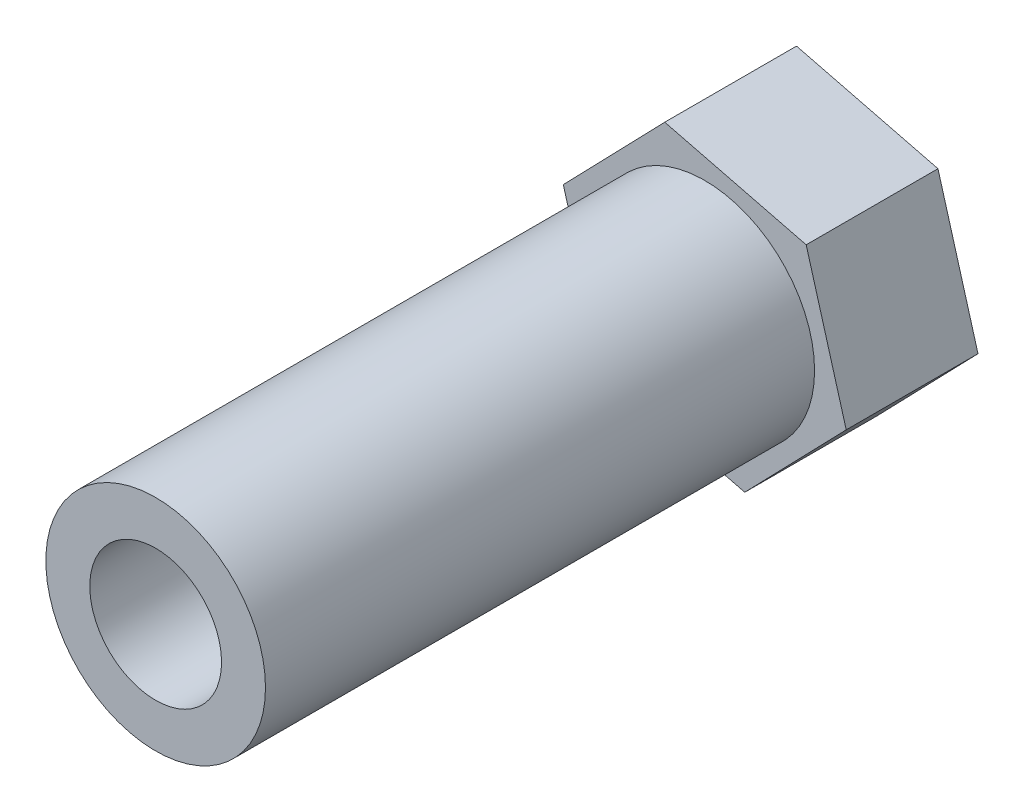
ISO-10303-21;
HEADER;
FILE_DESCRIPTION(('STEP AP214'),'2;1');
FILE_NAME('part.step','',(''),(''),'','','');
FILE_SCHEMA(('AUTOMOTIVE_DESIGN { 1 0 10303 214 1 1 1 1 }'));
ENDSEC;
DATA;
#1=APPLICATION_CONTEXT('core data for automotive mechanical design processes');
#2=APPLICATION_PROTOCOL_DEFINITION('international standard','automotive_design',2000,#1);
#3=PRODUCT_CONTEXT('',#1,'mechanical');
#4=PRODUCT('Part','Part','',(#3));
#5=PRODUCT_RELATED_PRODUCT_CATEGORY('part','',(#4));
#6=PRODUCT_DEFINITION_FORMATION('','',#4);
#7=PRODUCT_DEFINITION_CONTEXT('part definition',#1,'design');
#8=PRODUCT_DEFINITION('design','',#6,#7);
#9=PRODUCT_DEFINITION_SHAPE('','',#8);
#10=(LENGTH_UNIT() NAMED_UNIT(*) SI_UNIT(.MILLI.,.METRE.));
#11=(NAMED_UNIT(*) PLANE_ANGLE_UNIT() SI_UNIT($,.RADIAN.));
#12=(NAMED_UNIT(*) SI_UNIT($,.STERADIAN.) SOLID_ANGLE_UNIT());
#13=UNCERTAINTY_MEASURE_WITH_UNIT(LENGTH_MEASURE(1.E-05),#10,'distance_accuracy_value','');
#14=(GEOMETRIC_REPRESENTATION_CONTEXT(3) GLOBAL_UNCERTAINTY_ASSIGNED_CONTEXT((#13)) GLOBAL_UNIT_ASSIGNED_CONTEXT((#10,
#11,#12)) REPRESENTATION_CONTEXT('',''));
#15=CARTESIAN_POINT('',(0.,0.,0.));
#16=DIRECTION('',(0.,0.,1.));
#17=DIRECTION('',(1.,0.,0.));
#18=AXIS2_PLACEMENT_3D('',#15,#16,#17);
#19=CARTESIAN_POINT('',(0.,0.,6.));
#20=DIRECTION('',(0.,0.,1.));
#21=DIRECTION('',(1.,0.,0.));
#22=AXIS2_PLACEMENT_3D('',#19,#20,#21);
#23=PLANE('',#22);
#24=CARTESIAN_POINT('',(0.,0.,6.));
#25=DIRECTION('',(0.,0.,1.));
#26=DIRECTION('',(1.,0.,0.));
#27=AXIS2_PLACEMENT_3D('',#24,#25,#26);
#28=CIRCLE('',#27,1.5);
#29=CARTESIAN_POINT('',(1.5,0.,6.));
#30=VERTEX_POINT('',#29);
#31=EDGE_CURVE('E123',#30,#30,#28,.T.);
#32=ORIENTED_EDGE('',*,*,#31,.F.);
#33=EDGE_LOOP('',(#32));
#34=FACE_BOUND('',#33,.T.);
#35=CARTESIAN_POINT('',(0.,0.,6.));
#36=DIRECTION('',(0.,0.,1.));
#37=DIRECTION('',(1.,0.,0.));
#38=AXIS2_PLACEMENT_3D('',#35,#36,#37);
#39=CIRCLE('',#38,3.);
#40=CARTESIAN_POINT('',(3.,0.,6.));
#41=VERTEX_POINT('',#40);
#42=EDGE_CURVE('E158',#41,#41,#39,.T.);
#43=ORIENTED_EDGE('',*,*,#42,.T.);
#44=EDGE_LOOP('',(#43));
#45=FACE_BOUND('',#44,.T.);
#46=ADVANCED_FACE('F32',(#34,#45),#23,.T.);
#47=CARTESIAN_POINT('',(0.,0.,6.));
#48=DIRECTION('',(0.,0.,1.));
#49=DIRECTION('',(1.,0.,0.));
#50=AXIS2_PLACEMENT_3D('',#47,#48,#49);
#51=CIRCLE('',#50,5.);
#52=CARTESIAN_POINT('',(5.,0.,6.));
#53=VERTEX_POINT('',#52);
#54=EDGE_CURVE('E11',#53,#53,#51,.T.);
#55=ORIENTED_EDGE('',*,*,#54,.F.);
#56=EDGE_LOOP('',(#55));
#57=FACE_BOUND('',#56,.T.);
#58=DIRECTION('',(-0.69547698441572,-0.71854837286575,0.));
#59=VECTOR('',#58,1.);
#60=CARTESIAN_POINT('',(-1.82283365501434,6.38440371526429,6.));
#61=LINE('',#60,#59);
#62=CARTESIAN_POINT('',(-1.82283365501434,6.38440371526429,6.));
#63=VERTEX_POINT('',#62);
#64=CARTESIAN_POINT('',(-6.44047263294179,1.61358160551649,6.));
#65=VERTEX_POINT('',#64);
#66=EDGE_CURVE('E130',#63,#65,#61,.T.);
#67=ORIENTED_EDGE('',*,*,#66,.T.);
#68=DIRECTION('',(0.274542652541853,-0.961574922684282,0.));
#69=VECTOR('',#68,1.);
#70=CARTESIAN_POINT('',(-6.44047263294179,1.61358160551649,6.));
#71=LINE('',#70,#69);
#72=CARTESIAN_POINT('',(-4.61763897792746,-4.7708221097478,6.));
#73=VERTEX_POINT('',#72);
#74=EDGE_CURVE('E88',#65,#73,#71,.T.);
#75=ORIENTED_EDGE('',*,*,#74,.T.);
#76=DIRECTION('',(0.970019636957572,-0.243026549818532,0.));
#77=VECTOR('',#76,1.);
#78=CARTESIAN_POINT('',(-4.61763897792746,-4.7708221097478,6.));
#79=LINE('',#78,#77);
#80=CARTESIAN_POINT('',(1.82283365501434,-6.38440371526429,6.));
#81=VERTEX_POINT('',#80);
#82=EDGE_CURVE('E101',#73,#81,#79,.T.);
#83=ORIENTED_EDGE('',*,*,#82,.T.);
#84=DIRECTION('',(0.69547698441572,0.71854837286575,0.));
#85=VECTOR('',#84,1.);
#86=CARTESIAN_POINT('',(1.82283365501434,-6.38440371526429,6.));
#87=LINE('',#86,#85);
#88=CARTESIAN_POINT('',(6.44047263294179,-1.61358160551649,6.));
#89=VERTEX_POINT('',#88);
#90=EDGE_CURVE('E95',#81,#89,#87,.T.);
#91=ORIENTED_EDGE('',*,*,#90,.T.);
#92=DIRECTION('',(-0.274542652541853,0.961574922684282,0.));
#93=VECTOR('',#92,1.);
#94=CARTESIAN_POINT('',(6.44047263294179,-1.61358160551649,6.));
#95=LINE('',#94,#93);
#96=CARTESIAN_POINT('',(4.61763897792746,4.7708221097478,6.));
#97=VERTEX_POINT('',#96);
#98=EDGE_CURVE('E99',#89,#97,#95,.T.);
#99=ORIENTED_EDGE('',*,*,#98,.T.);
#100=DIRECTION('',(-0.970019636957572,0.243026549818532,0.));
#101=VECTOR('',#100,1.);
#102=CARTESIAN_POINT('',(4.61763897792746,4.7708221097478,6.));
#103=LINE('',#102,#101);
#104=EDGE_CURVE('E50',#97,#63,#103,.T.);
#105=ORIENTED_EDGE('',*,*,#104,.T.);
#106=EDGE_LOOP('',(#67,#75,#83,#91,#99,#105));
#107=FACE_BOUND('',#106,.T.);
#108=ADVANCED_FACE('F97',(#57,#107),#23,.T.);
#109=CARTESIAN_POINT('',(0.,0.,0.));
#110=DIRECTION('',(0.,0.,1.));
#111=DIRECTION('',(1.,0.,0.));
#112=AXIS2_PLACEMENT_3D('',#109,#110,#111);
#113=PLANE('',#112);
#114=DIRECTION('',(-0.69547698441572,-0.71854837286575,0.));
#115=VECTOR('',#114,1.);
#116=CARTESIAN_POINT('',(-1.82283365501434,6.38440371526429,0.));
#117=LINE('',#116,#115);
#118=CARTESIAN_POINT('',(-1.82283365501434,6.38440371526429,0.));
#119=VERTEX_POINT('',#118);
#120=CARTESIAN_POINT('',(-6.44047263294179,1.61358160551649,0.));
#121=VERTEX_POINT('',#120);
#122=EDGE_CURVE('E119',#119,#121,#117,.T.);
#123=ORIENTED_EDGE('',*,*,#122,.F.);
#124=DIRECTION('',(-0.970019636957572,0.243026549818532,0.));
#125=VECTOR('',#124,1.);
#126=CARTESIAN_POINT('',(4.61763897792746,4.7708221097478,0.));
#127=LINE('',#126,#125);
#128=CARTESIAN_POINT('',(4.61763897792746,4.7708221097478,0.));
#129=VERTEX_POINT('',#128);
#130=EDGE_CURVE('E79',#129,#119,#127,.T.);
#131=ORIENTED_EDGE('',*,*,#130,.F.);
#132=DIRECTION('',(-0.274542652541853,0.961574922684282,0.));
#133=VECTOR('',#132,1.);
#134=CARTESIAN_POINT('',(6.44047263294179,-1.61358160551649,0.));
#135=LINE('',#134,#133);
#136=CARTESIAN_POINT('',(6.44047263294179,-1.61358160551649,0.));
#137=VERTEX_POINT('',#136);
#138=EDGE_CURVE('E73',#137,#129,#135,.T.);
#139=ORIENTED_EDGE('',*,*,#138,.F.);
#140=DIRECTION('',(0.69547698441572,0.71854837286575,0.));
#141=VECTOR('',#140,1.);
#142=CARTESIAN_POINT('',(1.82283365501434,-6.38440371526429,0.));
#143=LINE('',#142,#141);
#144=CARTESIAN_POINT('',(1.82283365501434,-6.38440371526429,0.));
#145=VERTEX_POINT('',#144);
#146=EDGE_CURVE('E109',#145,#137,#143,.T.);
#147=ORIENTED_EDGE('',*,*,#146,.F.);
#148=DIRECTION('',(0.970019636957572,-0.243026549818532,0.));
#149=VECTOR('',#148,1.);
#150=CARTESIAN_POINT('',(-4.61763897792746,-4.7708221097478,0.));
#151=LINE('',#150,#149);
#152=CARTESIAN_POINT('',(-4.61763897792746,-4.7708221097478,0.));
#153=VERTEX_POINT('',#152);
#154=EDGE_CURVE('E125',#153,#145,#151,.T.);
#155=ORIENTED_EDGE('',*,*,#154,.F.);
#156=DIRECTION('',(0.274542652541853,-0.961574922684282,0.));
#157=VECTOR('',#156,1.);
#158=CARTESIAN_POINT('',(-6.44047263294179,1.61358160551649,0.));
#159=LINE('',#158,#157);
#160=EDGE_CURVE('E122',#121,#153,#159,.T.);
#161=ORIENTED_EDGE('',*,*,#160,.F.);
#162=EDGE_LOOP('',(#123,#131,#139,#147,#155,#161));
#163=FACE_BOUND('',#162,.T.);
#164=CARTESIAN_POINT('',(0.,0.,0.));
#165=DIRECTION('',(0.,0.,1.));
#166=DIRECTION('',(1.,0.,0.));
#167=AXIS2_PLACEMENT_3D('',#164,#165,#166);
#168=CIRCLE('',#167,1.5);
#169=CARTESIAN_POINT('',(1.5,0.,0.));
#170=VERTEX_POINT('',#169);
#171=EDGE_CURVE('E149',#170,#170,#168,.T.);
#172=ORIENTED_EDGE('',*,*,#171,.T.);
#173=EDGE_LOOP('',(#172));
#174=FACE_BOUND('',#173,.T.);
#175=ADVANCED_FACE('F143',(#163,#174),#113,.F.);
#176=CARTESIAN_POINT('',(-1.82283365501434,6.38440371526429,6.));
#177=DIRECTION('',(0.71854837286575,-0.695476984415719,0.));
#178=DIRECTION('',(0.69547698441572,0.71854837286575,0.));
#179=AXIS2_PLACEMENT_3D('',#176,#177,#178);
#180=PLANE('',#179);
#181=ORIENTED_EDGE('',*,*,#122,.T.);
#182=DIRECTION('',(0.,0.,-1.));
#183=VECTOR('',#182,1.);
#184=CARTESIAN_POINT('',(-6.44047263294179,1.61358160551649,6.));
#185=LINE('',#184,#183);
#186=EDGE_CURVE('E36',#65,#121,#185,.T.);
#187=ORIENTED_EDGE('',*,*,#186,.F.);
#188=ORIENTED_EDGE('',*,*,#66,.F.);
#189=DIRECTION('',(0.,0.,-1.));
#190=VECTOR('',#189,1.);
#191=CARTESIAN_POINT('',(-1.82283365501434,6.38440371526429,6.));
#192=LINE('',#191,#190);
#193=EDGE_CURVE('E115',#63,#119,#192,.T.);
#194=ORIENTED_EDGE('',*,*,#193,.T.);
#195=EDGE_LOOP('',(#181,#187,#188,#194));
#196=FACE_BOUND('',#195,.T.);
#197=ADVANCED_FACE('F34',(#196),#180,.F.);
#198=CARTESIAN_POINT('',(-6.44047263294179,1.61358160551649,6.));
#199=DIRECTION('',(0.961574922684282,0.274542652541853,0.));
#200=DIRECTION('',(-0.274542652541853,0.961574922684282,0.));
#201=AXIS2_PLACEMENT_3D('',#198,#199,#200);
#202=PLANE('',#201);
#203=ORIENTED_EDGE('',*,*,#160,.T.);
#204=DIRECTION('',(0.,0.,-1.));
#205=VECTOR('',#204,1.);
#206=CARTESIAN_POINT('',(-4.61763897792746,-4.7708221097478,6.));
#207=LINE('',#206,#205);
#208=EDGE_CURVE('E133',#73,#153,#207,.T.);
#209=ORIENTED_EDGE('',*,*,#208,.F.);
#210=ORIENTED_EDGE('',*,*,#74,.F.);
#211=ORIENTED_EDGE('',*,*,#186,.T.);
#212=EDGE_LOOP('',(#203,#209,#210,#211));
#213=FACE_BOUND('',#212,.T.);
#214=ADVANCED_FACE('F138',(#213),#202,.F.);
#215=CARTESIAN_POINT('',(-4.61763897792746,-4.7708221097478,6.));
#216=DIRECTION('',(0.243026549818532,0.970019636957572,0.));
#217=DIRECTION('',(-0.970019636957572,0.243026549818532,0.));
#218=AXIS2_PLACEMENT_3D('',#215,#216,#217);
#219=PLANE('',#218);
#220=ORIENTED_EDGE('',*,*,#154,.T.);
#221=DIRECTION('',(0.,0.,-1.));
#222=VECTOR('',#221,1.);
#223=CARTESIAN_POINT('',(1.82283365501434,-6.38440371526429,6.));
#224=LINE('',#223,#222);
#225=EDGE_CURVE('E110',#81,#145,#224,.T.);
#226=ORIENTED_EDGE('',*,*,#225,.F.);
#227=ORIENTED_EDGE('',*,*,#82,.F.);
#228=ORIENTED_EDGE('',*,*,#208,.T.);
#229=EDGE_LOOP('',(#220,#226,#227,#228));
#230=FACE_BOUND('',#229,.T.);
#231=ADVANCED_FACE('F145',(#230),#219,.F.);
#232=CARTESIAN_POINT('',(1.82283365501434,-6.38440371526429,6.));
#233=DIRECTION('',(-0.71854837286575,0.695476984415719,0.));
#234=DIRECTION('',(-0.69547698441572,-0.71854837286575,0.));
#235=AXIS2_PLACEMENT_3D('',#232,#233,#234);
#236=PLANE('',#235);
#237=ORIENTED_EDGE('',*,*,#146,.T.);
#238=DIRECTION('',(0.,0.,-1.));
#239=VECTOR('',#238,1.);
#240=CARTESIAN_POINT('',(6.44047263294179,-1.61358160551649,6.));
#241=LINE('',#240,#239);
#242=EDGE_CURVE('E106',#89,#137,#241,.T.);
#243=ORIENTED_EDGE('',*,*,#242,.F.);
#244=ORIENTED_EDGE('',*,*,#90,.F.);
#245=ORIENTED_EDGE('',*,*,#225,.T.);
#246=EDGE_LOOP('',(#237,#243,#244,#245));
#247=FACE_BOUND('',#246,.T.);
#248=ADVANCED_FACE('F107',(#247),#236,.F.);
#249=CARTESIAN_POINT('',(6.44047263294179,-1.61358160551649,6.));
#250=DIRECTION('',(-0.961574922684282,-0.274542652541853,0.));
#251=DIRECTION('',(0.274542652541853,-0.961574922684282,0.));
#252=AXIS2_PLACEMENT_3D('',#249,#250,#251);
#253=PLANE('',#252);
#254=ORIENTED_EDGE('',*,*,#138,.T.);
#255=DIRECTION('',(0.,0.,-1.));
#256=VECTOR('',#255,1.);
#257=CARTESIAN_POINT('',(4.61763897792746,4.7708221097478,6.));
#258=LINE('',#257,#256);
#259=EDGE_CURVE('E111',#97,#129,#258,.T.);
#260=ORIENTED_EDGE('',*,*,#259,.F.);
#261=ORIENTED_EDGE('',*,*,#98,.F.);
#262=ORIENTED_EDGE('',*,*,#242,.T.);
#263=EDGE_LOOP('',(#254,#260,#261,#262));
#264=FACE_BOUND('',#263,.T.);
#265=ADVANCED_FACE('F113',(#264),#253,.F.);
#266=CARTESIAN_POINT('',(4.61763897792746,4.7708221097478,6.));
#267=DIRECTION('',(-0.243026549818532,-0.970019636957572,0.));
#268=DIRECTION('',(0.970019636957573,-0.243026549818532,0.));
#269=AXIS2_PLACEMENT_3D('',#266,#267,#268);
#270=PLANE('',#269);
#271=ORIENTED_EDGE('',*,*,#130,.T.);
#272=ORIENTED_EDGE('',*,*,#193,.F.);
#273=ORIENTED_EDGE('',*,*,#104,.F.);
#274=ORIENTED_EDGE('',*,*,#259,.T.);
#275=EDGE_LOOP('',(#271,#272,#273,#274));
#276=FACE_BOUND('',#275,.T.);
#277=ADVANCED_FACE('F179',(#276),#270,.F.);
#278=CARTESIAN_POINT('',(0.,0.,6.));
#279=DIRECTION('',(0.,0.,-1.));
#280=DIRECTION('',(-1.,0.,0.));
#281=AXIS2_PLACEMENT_3D('',#278,#279,#280);
#282=CYLINDRICAL_SURFACE('',#281,1.5);
#283=ORIENTED_EDGE('',*,*,#31,.T.);
#284=EDGE_LOOP('',(#283));
#285=FACE_BOUND('',#284,.T.);
#286=ORIENTED_EDGE('',*,*,#171,.F.);
#287=EDGE_LOOP('',(#286));
#288=FACE_BOUND('',#287,.T.);
#289=ADVANCED_FACE('F170',(#285,#288),#282,.F.);
#290=CARTESIAN_POINT('',(0.,0.,31.));
#291=DIRECTION('',(0.,0.,1.));
#292=DIRECTION('',(1.,0.,0.));
#293=AXIS2_PLACEMENT_3D('',#290,#291,#292);
#294=PLANE('',#293);
#295=CARTESIAN_POINT('',(0.,0.,31.));
#296=DIRECTION('',(0.,0.,1.));
#297=DIRECTION('',(1.,0.,0.));
#298=AXIS2_PLACEMENT_3D('',#295,#296,#297);
#299=CIRCLE('',#298,5.);
#300=CARTESIAN_POINT('',(5.,0.,31.));
#301=VERTEX_POINT('',#300);
#302=EDGE_CURVE('E152',#301,#301,#299,.T.);
#303=ORIENTED_EDGE('',*,*,#302,.T.);
#304=EDGE_LOOP('',(#303));
#305=FACE_BOUND('',#304,.T.);
#306=CARTESIAN_POINT('',(0.,0.,31.));
#307=DIRECTION('',(0.,0.,1.));
#308=DIRECTION('',(1.,0.,0.));
#309=AXIS2_PLACEMENT_3D('',#306,#307,#308);
#310=CIRCLE('',#309,3.);
#311=CARTESIAN_POINT('',(3.,0.,31.));
#312=VERTEX_POINT('',#311);
#313=EDGE_CURVE('E157',#312,#312,#310,.T.);
#314=ORIENTED_EDGE('',*,*,#313,.F.);
#315=EDGE_LOOP('',(#314));
#316=FACE_BOUND('',#315,.T.);
#317=ADVANCED_FACE('F167',(#305,#316),#294,.T.);
#318=CARTESIAN_POINT('',(0.,0.,31.));
#319=DIRECTION('',(0.,0.,-1.));
#320=DIRECTION('',(-1.,0.,0.));
#321=AXIS2_PLACEMENT_3D('',#318,#319,#320);
#322=CYLINDRICAL_SURFACE('',#321,5.);
#323=ORIENTED_EDGE('',*,*,#302,.F.);
#324=EDGE_LOOP('',(#323));
#325=FACE_BOUND('',#324,.T.);
#326=ORIENTED_EDGE('',*,*,#54,.T.);
#327=EDGE_LOOP('',(#326));
#328=FACE_BOUND('',#327,.T.);
#329=ADVANCED_FACE('F169',(#325,#328),#322,.T.);
#330=CARTESIAN_POINT('',(0.,0.,31.));
#331=DIRECTION('',(0.,0.,-1.));
#332=DIRECTION('',(-1.,0.,0.));
#333=AXIS2_PLACEMENT_3D('',#330,#331,#332);
#334=CYLINDRICAL_SURFACE('',#333,3.);
#335=ORIENTED_EDGE('',*,*,#313,.T.);
#336=EDGE_LOOP('',(#335));
#337=FACE_BOUND('',#336,.T.);
#338=ORIENTED_EDGE('',*,*,#42,.F.);
#339=EDGE_LOOP('',(#338));
#340=FACE_BOUND('',#339,.T.);
#341=ADVANCED_FACE('F164',(#337,#340),#334,.F.);
#342=CLOSED_SHELL('',(#46,#108,#175,#197,#214,#231,#248,#265,#277,#289,#317,#329,#341));
#343=MANIFOLD_SOLID_BREP('B2',#342);
#344=ADVANCED_BREP_SHAPE_REPRESENTATION('',(#18,#343),#14);
#345=SHAPE_DEFINITION_REPRESENTATION(#9,#344);
ENDSEC;
END-ISO-10303-21;
